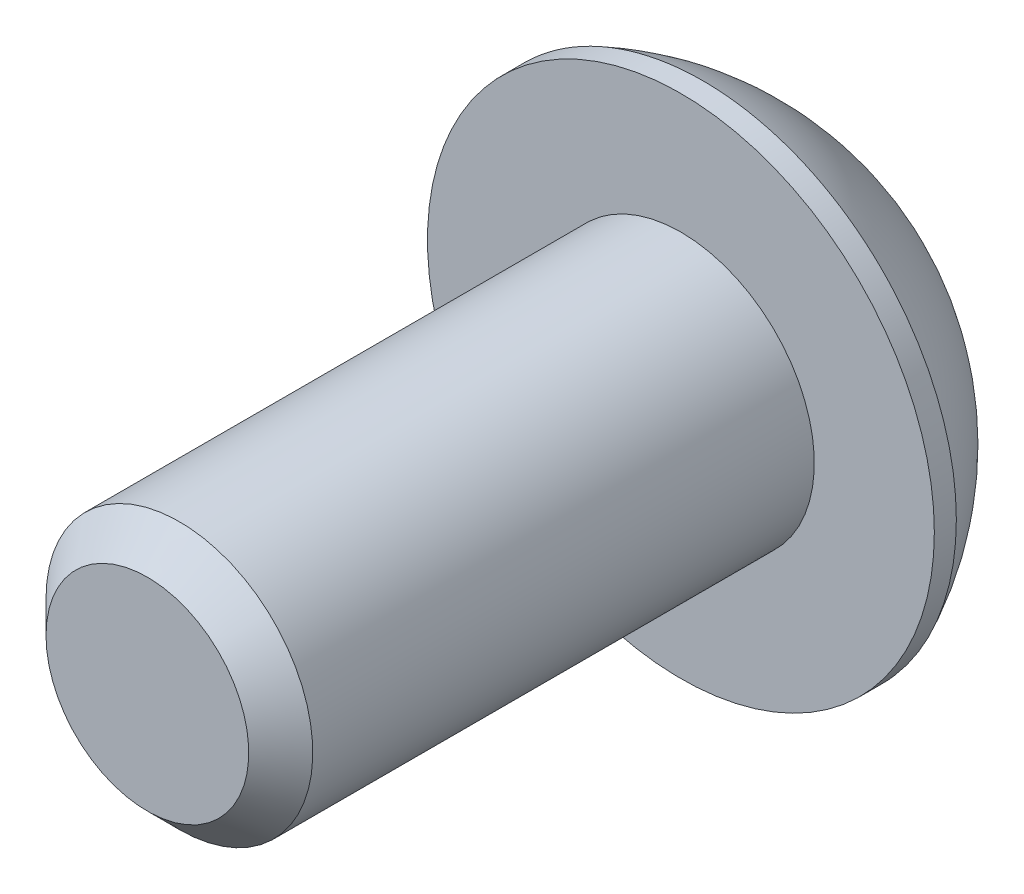
ISO-10303-21;
HEADER;
FILE_DESCRIPTION(('STEP AP214'),'2;1');
FILE_NAME('part.step','',(''),(''),'','','');
FILE_SCHEMA(('AUTOMOTIVE_DESIGN { 1 0 10303 214 1 1 1 1 }'));
ENDSEC;
DATA;
#1=APPLICATION_CONTEXT('core data for automotive mechanical design processes');
#2=APPLICATION_PROTOCOL_DEFINITION('international standard','automotive_design',2000,#1);
#3=PRODUCT_CONTEXT('',#1,'mechanical');
#4=PRODUCT('Part','Part','',(#3));
#5=PRODUCT_RELATED_PRODUCT_CATEGORY('part','',(#4));
#6=PRODUCT_DEFINITION_FORMATION('','',#4);
#7=PRODUCT_DEFINITION_CONTEXT('part definition',#1,'design');
#8=PRODUCT_DEFINITION('design','',#6,#7);
#9=PRODUCT_DEFINITION_SHAPE('','',#8);
#10=(LENGTH_UNIT() NAMED_UNIT(*) SI_UNIT(.MILLI.,.METRE.));
#11=(NAMED_UNIT(*) PLANE_ANGLE_UNIT() SI_UNIT($,.RADIAN.));
#12=(NAMED_UNIT(*) SI_UNIT($,.STERADIAN.) SOLID_ANGLE_UNIT());
#13=UNCERTAINTY_MEASURE_WITH_UNIT(LENGTH_MEASURE(1.E-05),#10,'distance_accuracy_value','');
#14=(GEOMETRIC_REPRESENTATION_CONTEXT(3) GLOBAL_UNCERTAINTY_ASSIGNED_CONTEXT((#13)) GLOBAL_UNIT_ASSIGNED_CONTEXT((#10,
#11,#12)) REPRESENTATION_CONTEXT('',''));
#15=CARTESIAN_POINT('',(0.,0.,0.));
#16=DIRECTION('',(0.,0.,1.));
#17=DIRECTION('',(1.,0.,0.));
#18=AXIS2_PLACEMENT_3D('',#15,#16,#17);
#19=CARTESIAN_POINT('',(1.5,-0.866025403784438,1.925));
#20=DIRECTION('',(0.,0.,1.));
#21=DIRECTION('',(1.,0.,0.));
#22=AXIS2_PLACEMENT_3D('',#19,#20,#21);
#23=PLANE('',#22);
#24=DIRECTION('',(-0.866025403784439,0.5,0.));
#25=VECTOR('',#24,1.);
#26=CARTESIAN_POINT('',(-1.5,-0.866025403784439,1.925));
#27=LINE('',#26,#25);
#28=CARTESIAN_POINT('',(-1.5,-0.866025403784439,1.925));
#29=VERTEX_POINT('',#28);
#30=CARTESIAN_POINT('',(0.,-1.73205080756888,1.925));
#31=VERTEX_POINT('',#30);
#32=EDGE_CURVE('E89',#29,#31,#27,.F.);
#33=ORIENTED_EDGE('',*,*,#32,.F.);
#34=DIRECTION('',(0.,1.,0.));
#35=VECTOR('',#34,1.);
#36=CARTESIAN_POINT('',(-1.5,0.866025403784438,1.925));
#37=LINE('',#36,#35);
#38=CARTESIAN_POINT('',(-1.5,0.86602540378444,1.925));
#39=VERTEX_POINT('',#38);
#40=EDGE_CURVE('E69',#39,#29,#37,.F.);
#41=ORIENTED_EDGE('',*,*,#40,.F.);
#42=DIRECTION('',(0.866025403784438,0.5,0.));
#43=VECTOR('',#42,1.);
#44=CARTESIAN_POINT('',(0.,1.73205080756888,1.925));
#45=LINE('',#44,#43);
#46=CARTESIAN_POINT('',(0.,1.73205080756888,1.925));
#47=VERTEX_POINT('',#46);
#48=EDGE_CURVE('E108',#47,#39,#45,.F.);
#49=ORIENTED_EDGE('',*,*,#48,.F.);
#50=DIRECTION('',(0.866025403784439,-0.5,0.));
#51=VECTOR('',#50,1.);
#52=CARTESIAN_POINT('',(1.5,0.866025403784439,1.925));
#53=LINE('',#52,#51);
#54=CARTESIAN_POINT('',(1.5,0.866025403784439,1.925));
#55=VERTEX_POINT('',#54);
#56=EDGE_CURVE('E74',#55,#47,#53,.F.);
#57=ORIENTED_EDGE('',*,*,#56,.F.);
#58=DIRECTION('',(0.,1.,0.));
#59=VECTOR('',#58,1.);
#60=CARTESIAN_POINT('',(1.5,-0.866025403784438,1.925));
#61=LINE('',#60,#59);
#62=CARTESIAN_POINT('',(1.5,-0.866025403784439,1.925));
#63=VERTEX_POINT('',#62);
#64=EDGE_CURVE('E116',#63,#55,#61,.T.);
#65=ORIENTED_EDGE('',*,*,#64,.F.);
#66=DIRECTION('',(-0.866025403784438,-0.5,0.));
#67=VECTOR('',#66,1.);
#68=CARTESIAN_POINT('',(0.,-1.73205080756888,1.925));
#69=LINE('',#68,#67);
#70=EDGE_CURVE('E91',#31,#63,#69,.F.);
#71=ORIENTED_EDGE('',*,*,#70,.F.);
#72=EDGE_LOOP('',(#33,#41,#49,#57,#65,#71));
#73=FACE_BOUND('',#72,.T.);
#74=ADVANCED_FACE('F17',(#73),#23,.F.);
#75=CARTESIAN_POINT('',(-1.5,0.866025403784438,1.925));
#76=DIRECTION('',(1.,0.,0.));
#77=DIRECTION('',(0.,1.,0.));
#78=AXIS2_PLACEMENT_3D('',#75,#76,#77);
#79=PLANE('',#78);
#80=DIRECTION('',(0.,0.,1.));
#81=VECTOR('',#80,1.);
#82=CARTESIAN_POINT('',(-1.5,-0.866025403784439,1.925));
#83=LINE('',#82,#81);
#84=CARTESIAN_POINT('',(-1.50000000002135,-0.866025403796766,2.46510916132268E-11));
#85=VERTEX_POINT('',#84);
#86=EDGE_CURVE('E59',#85,#29,#83,.T.);
#87=ORIENTED_EDGE('',*,*,#86,.F.);
#88=CARTESIAN_POINT('',(-1.4999999999998,-0.866025403812883,3.497257389451E-11));
#89=CARTESIAN_POINT('',(-1.49999999999993,-0.806493971458483,0.0297371504859719));
#90=CARTESIAN_POINT('',(-1.49999999999998,-0.745967172639482,0.0577274997356712));
#91=CARTESIAN_POINT('',(-1.50000000000002,-0.622546818448653,0.108976634302055));
#92=CARTESIAN_POINT('',(-1.50000000000001,-0.559641532208188,0.132206913934862));
#93=CARTESIAN_POINT('',(-1.5,-0.432796107455125,0.172000539080811));
#94=CARTESIAN_POINT('',(-1.5,-0.368888255245699,0.188663877377684));
#95=CARTESIAN_POINT('',(-1.5,-0.239666012718551,0.214336924424236));
#96=CARTESIAN_POINT('',(-1.5,-0.174355567110582,0.223365789946761));
#97=CARTESIAN_POINT('',(-1.5,-0.0617869553803678,0.231512589389946));
#98=CARTESIAN_POINT('',(-1.5,-0.0146740941290627,0.232718117598397));
#99=CARTESIAN_POINT('',(-1.5,0.0794684067864031,0.230683861885897));
#100=CARTESIAN_POINT('',(-1.5,0.126498025769629,0.227443096008092));
#101=CARTESIAN_POINT('',(-1.5,0.22010432228685,0.21670269479537));
#102=CARTESIAN_POINT('',(-1.5,0.266680537614034,0.209199099190673));
#103=CARTESIAN_POINT('',(-1.5,0.359051186180354,0.190340526502742));
#104=CARTESIAN_POINT('',(-1.5,0.404845275088566,0.178983896805698));
#105=CARTESIAN_POINT('',(-1.5,0.522097698449399,0.145281418704612));
#106=CARTESIAN_POINT('',(-1.5,0.592830045625335,0.120399016572433));
#107=CARTESIAN_POINT('',(-1.5,0.696834190269759,0.0783962698582894));
#108=CARTESIAN_POINT('',(-1.5,0.731106784740956,0.0636393457765503));
#109=CARTESIAN_POINT('',(-1.5,0.799022021654026,0.0327784721118597));
#110=CARTESIAN_POINT('',(-1.5,0.832664954619754,0.0166751634844623));
#111=CARTESIAN_POINT('',(-1.5,0.866025403812908,3.50675416900233E-11));
#112=B_SPLINE_CURVE_WITH_KNOTS('',3,(#88,#89,#90,#91,#92,#93,#94,#95,#96,#97,#98,#99,#100,#101,
#102,#103,#104,#105,#106,#107,#108,#109,#110,#111),.UNSPECIFIED.,.F.,.F.,(4,2,2,2,2,2,2,2,2,2,2,
4),(0.,0.199774419877747,0.400712312213008,0.598459990242252,0.795709985580835,
0.936894690699466,1.07811058125136,1.21945787975417,1.36086588065946,1.58533909974464,
1.69726364726936,1.80913521246463),.UNSPECIFIED.);
#113=CARTESIAN_POINT('',(-1.5000000000427,0.866025403774032,1.75297927214847E-11));
#114=VERTEX_POINT('',#113);
#115=EDGE_CURVE('E20',#85,#114,#112,.T.);
#116=ORIENTED_EDGE('',*,*,#115,.T.);
#117=DIRECTION('',(0.,0.,1.));
#118=VECTOR('',#117,1.);
#119=CARTESIAN_POINT('',(-1.5,0.86602540378444,1.925));
#120=LINE('',#119,#118);
#121=EDGE_CURVE('E85',#39,#114,#120,.F.);
#122=ORIENTED_EDGE('',*,*,#121,.F.);
#123=ORIENTED_EDGE('',*,*,#40,.T.);
#124=EDGE_LOOP('',(#87,#116,#122,#123));
#125=FACE_BOUND('',#124,.T.);
#126=ADVANCED_FACE('F84',(#125),#79,.T.);
#127=CARTESIAN_POINT('',(-1.5,-0.866025403784439,1.925));
#128=DIRECTION('',(0.5,0.866025403784439,0.));
#129=DIRECTION('',(-0.866025403784439,0.5,0.));
#130=AXIS2_PLACEMENT_3D('',#127,#128,#129);
#131=PLANE('',#130);
#132=DIRECTION('',(0.,0.,1.));
#133=VECTOR('',#132,1.);
#134=CARTESIAN_POINT('',(0.,-1.73205080756888,1.925));
#135=LINE('',#134,#133);
#136=CARTESIAN_POINT('',(0.,-1.73205080759353,2.46497940526791E-11));
#137=VERTEX_POINT('',#136);
#138=EDGE_CURVE('E94',#137,#31,#135,.T.);
#139=ORIENTED_EDGE('',*,*,#138,.F.);
#140=CARTESIAN_POINT('',(2.47314203792776E-11,-1.73205080758293,3.49731040819305E-11));
#141=CARTESIAN_POINT('',(-0.0515557327287603,-1.70228509139958,0.029737150484999));
#142=CARTESIAN_POINT('',(-0.103973478126701,-1.67202169198382,0.0577274997332092));
#143=CARTESIAN_POINT('',(-0.210858640221861,-1.61031151487585,0.108976634295228));
#144=CARTESIAN_POINT('',(-0.265336216149327,-1.57885887174931,0.132206913925155));
#145=CARTESIAN_POINT('',(-0.375187576360522,-1.51543615936052,0.172000539063643));
#146=CARTESIAN_POINT('',(-0.430533399885507,-1.48348223324985,0.188663877355986));
#147=CARTESIAN_POINT('',(-0.542443144668121,-1.41887111197467,0.214336924391903));
#148=CARTESIAN_POINT('',(-0.599003649706895,-1.38621588916503,0.223365789908325));
#149=CARTESIAN_POINT('',(-0.696490927156704,-1.32993158328682,0.231512589340654));
#150=CARTESIAN_POINT('',(-0.737291861858444,-1.30637515265358,0.232718117543908));
#151=CARTESIAN_POINT('',(-0.818821659252819,-1.25930390218097,0.230683861819339));
#152=CARTESIAN_POINT('',(-0.859550504035242,-1.23578909268205,0.22744309593466));
#153=CARTESIAN_POINT('',(-0.940615934798046,-1.18898594440917,0.216702694706976));
#154=CARTESIAN_POINT('',(-0.980952120495589,-1.16569783673861,0.20919909909419));
#155=CARTESIAN_POINT('',(-1.06094744874167,-1.11951251244183,0.19034052638936));
#156=CARTESIAN_POINT('',(-1.10060629309087,-1.09661546798107,0.178983896683506));
#157=CARTESIAN_POINT('',(-1.20214987033849,-1.03798925632268,0.145281418581615));
#158=CARTESIAN_POINT('',(-1.26340587981439,-1.00262308276228,0.120399016466317));
#159=CARTESIAN_POINT('',(-1.35347611110698,-0.950621010479538,0.0783962697862537));
#160=CARTESIAN_POINT('',(-1.38315704855032,-0.93348471325682,0.0636393457173699));
#161=CARTESIAN_POINT('',(-1.44197336897757,-0.899527094825408,0.0327784720806831));
#162=CARTESIAN_POINT('',(-1.4711090035625,-0.882705628354788,0.0166751634684291));
#163=CARTESIAN_POINT('',(-1.50000000002465,-0.866025403770205,3.50675335169267E-11));
#164=B_SPLINE_CURVE_WITH_KNOTS('',3,(#140,#141,#142,#143,#144,#145,#146,#147,#148,#149,#150,
#151,#152,#153,#154,#155,#156,#157,#158,#159,#160,#161,#162,#163),.UNSPECIFIED.,.F.,.F.,(4,2,2,
2,2,2,2,2,2,2,2,4),(0.,0.199774419910088,0.4007123122777,0.598459990337995,0.795709985707603,
0.936894690871224,1.07811058146816,1.21945788001607,1.36086588096647,1.58533909988034,
1.69726364731887,1.80913521242832),.UNSPECIFIED.);
#165=EDGE_CURVE('E98',#137,#85,#164,.T.);
#166=ORIENTED_EDGE('',*,*,#165,.T.);
#167=ORIENTED_EDGE('',*,*,#86,.T.);
#168=ORIENTED_EDGE('',*,*,#32,.T.);
#169=EDGE_LOOP('',(#139,#166,#167,#168));
#170=FACE_BOUND('',#169,.T.);
#171=ADVANCED_FACE('F96',(#170),#131,.T.);
#172=CARTESIAN_POINT('',(0.,-1.73205080756888,1.925));
#173=DIRECTION('',(-0.5,0.866025403784438,0.));
#174=DIRECTION('',(-0.866025403784438,-0.5,0.));
#175=AXIS2_PLACEMENT_3D('',#172,#173,#174);
#176=PLANE('',#175);
#177=DIRECTION('',(0.,0.,1.));
#178=VECTOR('',#177,1.);
#179=CARTESIAN_POINT('',(1.5,-0.866025403784439,1.925));
#180=LINE('',#179,#178);
#181=CARTESIAN_POINT('',(1.50000000002135,-0.866025403796764,2.46510166454315E-11));
#182=VERTEX_POINT('',#181);
#183=EDGE_CURVE('E118',#182,#63,#180,.T.);
#184=ORIENTED_EDGE('',*,*,#183,.F.);
#185=CARTESIAN_POINT('',(1.50000000002453,-0.86602540377005,3.49716705376729E-11));
#186=CARTESIAN_POINT('',(1.44844426727117,-0.895791119953619,0.0297371504849977));
#187=CARTESIAN_POINT('',(1.39602652187328,-0.926054519369463,0.0577274997332081));
#188=CARTESIAN_POINT('',(1.28914135977816,-0.987764696477502,0.108976634295226));
#189=CARTESIAN_POINT('',(1.23466378385068,-1.01921733960401,0.132206913925153));
#190=CARTESIAN_POINT('',(1.12481242363947,-1.08264005199279,0.172000539063641));
#191=CARTESIAN_POINT('',(1.06946660011449,-1.11459397810346,0.188663877355984));
#192=CARTESIAN_POINT('',(0.957556855331882,-1.17920509937865,0.214336924391901));
#193=CARTESIAN_POINT('',(0.900996350293107,-1.21186032218829,0.223365789908323));
#194=CARTESIAN_POINT('',(0.803509072843297,-1.2681446280665,0.231512589340651));
#195=CARTESIAN_POINT('',(0.762708138141558,-1.29170105869973,0.232718117543906));
#196=CARTESIAN_POINT('',(0.681178340747183,-1.33877230917235,0.230683861819337));
#197=CARTESIAN_POINT('',(0.64044949596476,-1.36228711867127,0.227443095934657));
#198=CARTESIAN_POINT('',(0.559384065201955,-1.40909026694414,0.216702694706973));
#199=CARTESIAN_POINT('',(0.519047879504413,-1.4323783746147,0.209199099094188));
#200=CARTESIAN_POINT('',(0.439052551258335,-1.47856369891149,0.190340526389358));
#201=CARTESIAN_POINT('',(0.399393706909129,-1.50146074337225,0.178983896683504));
#202=CARTESIAN_POINT('',(0.29785012966151,-1.56008695503064,0.145281418581613));
#203=CARTESIAN_POINT('',(0.236594120185611,-1.59545312859104,0.120399016466315));
#204=CARTESIAN_POINT('',(0.146523888893026,-1.64745520087378,0.0783962697862515));
#205=CARTESIAN_POINT('',(0.116842951449678,-1.6645914980965,0.0636393457173677));
#206=CARTESIAN_POINT('',(0.0580266310224356,-1.69854911652791,0.0327784720806809));
#207=CARTESIAN_POINT('',(0.0288909964375044,-1.71537058299853,0.0166751634684269));
#208=CARTESIAN_POINT('',(-2.46528885257916E-11,-1.73205080758311,3.50654309737692E-11));
#209=B_SPLINE_CURVE_WITH_KNOTS('',3,(#185,#186,#187,#188,#189,#190,#191,#192,#193,#194,#195,
#196,#197,#198,#199,#200,#201,#202,#203,#204,#205,#206,#207,#208),.UNSPECIFIED.,.F.,.F.,(4,2,2,
2,2,2,2,2,2,2,2,4),(0.,0.199774419910088,0.400712312277698,0.598459990337992,0.795709985707599,
0.93689469087122,1.07811058146816,1.21945788001607,1.36086588096647,1.58533909988034,
1.69726364731887,1.80913521242832),.UNSPECIFIED.);
#210=EDGE_CURVE('E176',#182,#137,#209,.T.);
#211=ORIENTED_EDGE('',*,*,#210,.T.);
#212=ORIENTED_EDGE('',*,*,#138,.T.);
#213=ORIENTED_EDGE('',*,*,#70,.T.);
#214=EDGE_LOOP('',(#184,#211,#212,#213));
#215=FACE_BOUND('',#214,.T.);
#216=ADVANCED_FACE('F174',(#215),#176,.T.);
#217=CARTESIAN_POINT('',(1.5,-0.866025403784438,1.925));
#218=DIRECTION('',(-1.,0.,0.));
#219=DIRECTION('',(0.,0.,1.));
#220=AXIS2_PLACEMENT_3D('',#217,#218,#219);
#221=PLANE('',#220);
#222=DIRECTION('',(0.,0.,1.));
#223=VECTOR('',#222,1.);
#224=CARTESIAN_POINT('',(1.5,0.866025403784439,1.925));
#225=LINE('',#224,#223);
#226=CARTESIAN_POINT('',(1.50000000002135,0.866025403796765,2.46510166454315E-11));
#227=VERTEX_POINT('',#226);
#228=EDGE_CURVE('E113',#227,#55,#225,.T.);
#229=ORIENTED_EDGE('',*,*,#228,.F.);
#230=CARTESIAN_POINT('',(1.4999999999998,0.866025403812882,3.49731264126921E-11));
#231=CARTESIAN_POINT('',(1.49999999999993,0.806493971458483,0.0297371504859723));
#232=CARTESIAN_POINT('',(1.49999999999998,0.745967172639481,0.0577274997356716));
#233=CARTESIAN_POINT('',(1.50000000000002,0.622546818448653,0.108976634302055));
#234=CARTESIAN_POINT('',(1.50000000000001,0.559641532208188,0.132206913934863));
#235=CARTESIAN_POINT('',(1.5,0.432796107455125,0.172000539080811));
#236=CARTESIAN_POINT('',(1.5,0.368888255245699,0.188663877377684));
#237=CARTESIAN_POINT('',(1.5,0.239666012718551,0.214336924424236));
#238=CARTESIAN_POINT('',(1.5,0.174355567110582,0.223365789946761));
#239=CARTESIAN_POINT('',(1.5,0.0617869553803679,0.231512589389946));
#240=CARTESIAN_POINT('',(1.5,0.0146740941290628,0.232718117598397));
#241=CARTESIAN_POINT('',(1.5,-0.0794684067864029,0.230683861885897));
#242=CARTESIAN_POINT('',(1.5,-0.126498025769629,0.227443096008093));
#243=CARTESIAN_POINT('',(1.5,-0.220104322286849,0.21670269479537));
#244=CARTESIAN_POINT('',(1.5,-0.266680537614034,0.209199099190673));
#245=CARTESIAN_POINT('',(1.5,-0.359051186180354,0.190340526502742));
#246=CARTESIAN_POINT('',(1.5,-0.404845275088565,0.178983896805698));
#247=CARTESIAN_POINT('',(1.5,-0.522097698449399,0.145281418704612));
#248=CARTESIAN_POINT('',(1.5,-0.592830045625335,0.120399016572433));
#249=CARTESIAN_POINT('',(1.5,-0.69683419026976,0.0783962698582893));
#250=CARTESIAN_POINT('',(1.5,-0.731106784740956,0.0636393457765502));
#251=CARTESIAN_POINT('',(1.5,-0.799022021654026,0.0327784721118594));
#252=CARTESIAN_POINT('',(1.5,-0.832664954619755,0.0166751634844619));
#253=CARTESIAN_POINT('',(1.5,-0.866025403812909,3.5067108651531E-11));
#254=B_SPLINE_CURVE_WITH_KNOTS('',3,(#230,#231,#232,#233,#234,#235,#236,#237,#238,#239,#240,
#241,#242,#243,#244,#245,#246,#247,#248,#249,#250,#251,#252,#253),.UNSPECIFIED.,.F.,.F.,(4,2,2,
2,2,2,2,2,2,2,2,4),(0.,0.199774419877746,0.400712312213007,0.598459990242251,0.795709985580833,
0.936894690699465,1.07811058125136,1.21945787975417,1.36086588065946,1.58533909974464,
1.69726364726936,1.80913521246463),.UNSPECIFIED.);
#255=EDGE_CURVE('E181',#227,#182,#254,.T.);
#256=ORIENTED_EDGE('',*,*,#255,.T.);
#257=ORIENTED_EDGE('',*,*,#183,.T.);
#258=ORIENTED_EDGE('',*,*,#64,.T.);
#259=EDGE_LOOP('',(#229,#256,#257,#258));
#260=FACE_BOUND('',#259,.T.);
#261=ADVANCED_FACE('F233',(#260),#221,.T.);
#262=CARTESIAN_POINT('',(1.5,0.866025403784439,1.925));
#263=DIRECTION('',(-0.5,-0.866025403784439,0.));
#264=DIRECTION('',(0.866025403784439,-0.5,0.));
#265=AXIS2_PLACEMENT_3D('',#262,#263,#264);
#266=PLANE('',#265);
#267=DIRECTION('',(0.,0.,1.));
#268=VECTOR('',#267,1.);
#269=CARTESIAN_POINT('',(0.,1.73205080756888,1.925));
#270=LINE('',#269,#268);
#271=CARTESIAN_POINT('',(0.,1.73205080759353,2.46496717940041E-11));
#272=VERTEX_POINT('',#271);
#273=EDGE_CURVE('E40',#272,#47,#270,.T.);
#274=ORIENTED_EDGE('',*,*,#273,.F.);
#275=CARTESIAN_POINT('',(-2.47305004476744E-11,1.73205080758293,3.49737059739202E-11));
#276=CARTESIAN_POINT('',(0.051555732728761,1.70228509139958,0.0297371504849995));
#277=CARTESIAN_POINT('',(0.103973478126702,1.67202169198382,0.0577274997332096));
#278=CARTESIAN_POINT('',(0.210858640221861,1.61031151487585,0.108976634295228));
#279=CARTESIAN_POINT('',(0.265336216149327,1.57885887174931,0.132206913925155));
#280=CARTESIAN_POINT('',(0.375187576360522,1.51543615936052,0.172000539063643));
#281=CARTESIAN_POINT('',(0.430533399885507,1.48348223324985,0.188663877355987));
#282=CARTESIAN_POINT('',(0.542443144668121,1.41887111197467,0.214336924391904));
#283=CARTESIAN_POINT('',(0.599003649706895,1.38621588916503,0.223365789908325));
#284=CARTESIAN_POINT('',(0.696490927156705,1.32993158328682,0.231512589340654));
#285=CARTESIAN_POINT('',(0.737291861858444,1.30637515265358,0.232718117543908));
#286=CARTESIAN_POINT('',(0.81882165925282,1.25930390218097,0.230683861819339));
#287=CARTESIAN_POINT('',(0.859550504035242,1.23578909268205,0.22744309593466));
#288=CARTESIAN_POINT('',(0.940615934798047,1.18898594440917,0.216702694706976));
#289=CARTESIAN_POINT('',(0.980952120495589,1.16569783673861,0.20919909909419));
#290=CARTESIAN_POINT('',(1.06094744874167,1.11951251244183,0.19034052638936));
#291=CARTESIAN_POINT('',(1.10060629309087,1.09661546798107,0.178983896683506));
#292=CARTESIAN_POINT('',(1.20214987033849,1.03798925632268,0.145281418581615));
#293=CARTESIAN_POINT('',(1.26340587981439,1.00262308276228,0.120399016466317));
#294=CARTESIAN_POINT('',(1.35347611110698,0.950621010479537,0.0783962697862536));
#295=CARTESIAN_POINT('',(1.38315704855032,0.93348471325682,0.0636393457173698));
#296=CARTESIAN_POINT('',(1.44197336897757,0.899527094825408,0.0327784720806828));
#297=CARTESIAN_POINT('',(1.4711090035625,0.882705628354787,0.0166751634684288));
#298=CARTESIAN_POINT('',(1.50000000002466,0.866025403770204,3.50673327179663E-11));
#299=B_SPLINE_CURVE_WITH_KNOTS('',3,(#275,#276,#277,#278,#279,#280,#281,#282,#283,#284,#285,
#286,#287,#288,#289,#290,#291,#292,#293,#294,#295,#296,#297,#298),.UNSPECIFIED.,.F.,.F.,(4,2,2,
2,2,2,2,2,2,2,2,4),(0.,0.199774419910088,0.4007123122777,0.598459990337994,0.795709985707602,
0.936894690871223,1.07811058146816,1.21945788001607,1.36086588096647,1.58533909988034,
1.69726364731887,1.80913521242832),.UNSPECIFIED.);
#300=EDGE_CURVE('E212',#272,#227,#299,.T.);
#301=ORIENTED_EDGE('',*,*,#300,.T.);
#302=ORIENTED_EDGE('',*,*,#228,.T.);
#303=ORIENTED_EDGE('',*,*,#56,.T.);
#304=EDGE_LOOP('',(#274,#301,#302,#303));
#305=FACE_BOUND('',#304,.T.);
#306=ADVANCED_FACE('F226',(#305),#266,.T.);
#307=CARTESIAN_POINT('',(0.,1.73205080756888,1.925));
#308=DIRECTION('',(0.5,-0.866025403784438,0.));
#309=DIRECTION('',(0.866025403784438,0.5,0.));
#310=AXIS2_PLACEMENT_3D('',#307,#308,#309);
#311=PLANE('',#310);
#312=ORIENTED_EDGE('',*,*,#121,.T.);
#313=CARTESIAN_POINT('',(-1.50000000002453,0.866025403770049,3.49715716480713E-11));
#314=CARTESIAN_POINT('',(-1.44844426727117,0.895791119953618,0.0297371504849977));
#315=CARTESIAN_POINT('',(-1.39602652187328,0.926054519369463,0.0577274997332081));
#316=CARTESIAN_POINT('',(-1.28914135977816,0.987764696477502,0.108976634295226));
#317=CARTESIAN_POINT('',(-1.23466378385068,1.01921733960401,0.132206913925154));
#318=CARTESIAN_POINT('',(-1.12481242363947,1.08264005199279,0.172000539063642));
#319=CARTESIAN_POINT('',(-1.06946660011449,1.11459397810346,0.188663877355985));
#320=CARTESIAN_POINT('',(-0.957556855331882,1.17920509937865,0.214336924391901));
#321=CARTESIAN_POINT('',(-0.900996350293106,1.21186032218828,0.223365789908323));
#322=CARTESIAN_POINT('',(-0.803509072843297,1.2681446280665,0.231512589340651));
#323=CARTESIAN_POINT('',(-0.762708138141558,1.29170105869973,0.232718117543906));
#324=CARTESIAN_POINT('',(-0.681178340747182,1.33877230917235,0.230683861819337));
#325=CARTESIAN_POINT('',(-0.64044949596476,1.36228711867127,0.227443095934658));
#326=CARTESIAN_POINT('',(-0.559384065201955,1.40909026694414,0.216702694706974));
#327=CARTESIAN_POINT('',(-0.519047879504412,1.4323783746147,0.209199099094188));
#328=CARTESIAN_POINT('',(-0.439052551258335,1.47856369891149,0.190340526389358));
#329=CARTESIAN_POINT('',(-0.399393706909128,1.50146074337225,0.178983896683504));
#330=CARTESIAN_POINT('',(-0.297850129661509,1.56008695503064,0.145281418581613));
#331=CARTESIAN_POINT('',(-0.23659412018561,1.59545312859104,0.120399016466315));
#332=CARTESIAN_POINT('',(-0.146523888893025,1.64745520087378,0.0783962697862515));
#333=CARTESIAN_POINT('',(-0.116842951449677,1.6645914980965,0.0636393457173676));
#334=CARTESIAN_POINT('',(-0.0580266310224344,1.69854911652791,0.0327784720806807));
#335=CARTESIAN_POINT('',(-0.0288909964375033,1.71537058299853,0.0166751634684267));
#336=CARTESIAN_POINT('',(2.46540148375053E-11,1.73205080758311,3.50653193413085E-11));
#337=B_SPLINE_CURVE_WITH_KNOTS('',3,(#313,#314,#315,#316,#317,#318,#319,#320,#321,#322,#323,
#324,#325,#326,#327,#328,#329,#330,#331,#332,#333,#334,#335,#336),.UNSPECIFIED.,.F.,.F.,(4,2,2,
2,2,2,2,2,2,2,2,4),(0.,0.199774419910088,0.400712312277699,0.598459990337993,0.795709985707601,
0.936894690871222,1.07811058146816,1.21945788001607,1.36086588096647,1.58533909988034,
1.69726364731887,1.80913521242832),.UNSPECIFIED.);
#338=EDGE_CURVE('E202',#114,#272,#337,.T.);
#339=ORIENTED_EDGE('',*,*,#338,.T.);
#340=ORIENTED_EDGE('',*,*,#273,.T.);
#341=ORIENTED_EDGE('',*,*,#48,.T.);
#342=EDGE_LOOP('',(#312,#339,#340,#341));
#343=FACE_BOUND('',#342,.T.);
#344=ADVANCED_FACE('F222',(#343),#311,.T.);
#345=CARTESIAN_POINT('',(0.,0.,0.));
#346=DIRECTION('',(0.,0.,-1.));
#347=DIRECTION('',(-1.,0.,0.));
#348=AXIS2_PLACEMENT_3D('',#345,#346,#347);
#349=CONICAL_SURFACE('',#348,1.73205080761818,0.785398163397448);
#350=ORIENTED_EDGE('',*,*,#115,.F.);
#351=CARTESIAN_POINT('',(0.,0.,0.));
#352=DIRECTION('',(0.,0.,-1.));
#353=DIRECTION('',(-1.,0.,0.));
#354=AXIS2_PLACEMENT_3D('',#351,#352,#353);
#355=CIRCLE('',#354,1.73205080761818);
#356=EDGE_CURVE('E200',#114,#85,#355,.F.);
#357=ORIENTED_EDGE('',*,*,#356,.F.);
#358=EDGE_LOOP('',(#350,#357));
#359=FACE_BOUND('',#358,.T.);
#360=ADVANCED_FACE('F225',(#359),#349,.F.);
#361=CARTESIAN_POINT('',(0.,0.,0.));
#362=DIRECTION('',(0.,0.,-1.));
#363=DIRECTION('',(-1.,0.,0.));
#364=AXIS2_PLACEMENT_3D('',#361,#362,#363);
#365=CONICAL_SURFACE('',#364,1.73205080761818,0.785398163519197);
#366=ORIENTED_EDGE('',*,*,#165,.F.);
#367=CARTESIAN_POINT('',(0.,0.,0.));
#368=DIRECTION('',(0.,0.,-1.));
#369=DIRECTION('',(-1.,0.,0.));
#370=AXIS2_PLACEMENT_3D('',#367,#368,#369);
#371=CIRCLE('',#370,1.73205080761818);
#372=EDGE_CURVE('E187',#85,#137,#371,.F.);
#373=ORIENTED_EDGE('',*,*,#372,.F.);
#374=EDGE_LOOP('',(#366,#373));
#375=FACE_BOUND('',#374,.T.);
#376=ADVANCED_FACE('F185',(#375),#365,.F.);
#377=CARTESIAN_POINT('',(0.,0.,0.));
#378=DIRECTION('',(0.,0.,-1.));
#379=DIRECTION('',(-1.,0.,0.));
#380=AXIS2_PLACEMENT_3D('',#377,#378,#379);
#381=CONICAL_SURFACE('',#380,1.73205080761818,0.785398163519197);
#382=ORIENTED_EDGE('',*,*,#210,.F.);
#383=CARTESIAN_POINT('',(0.,0.,0.));
#384=DIRECTION('',(0.,0.,-1.));
#385=DIRECTION('',(-1.,0.,0.));
#386=AXIS2_PLACEMENT_3D('',#383,#384,#385);
#387=CIRCLE('',#386,1.73205080761818);
#388=EDGE_CURVE('E190',#137,#182,#387,.F.);
#389=ORIENTED_EDGE('',*,*,#388,.F.);
#390=EDGE_LOOP('',(#382,#389));
#391=FACE_BOUND('',#390,.T.);
#392=ADVANCED_FACE('F191',(#391),#381,.F.);
#393=CARTESIAN_POINT('',(0.,0.,0.));
#394=DIRECTION('',(0.,0.,-1.));
#395=DIRECTION('',(-1.,0.,0.));
#396=AXIS2_PLACEMENT_3D('',#393,#394,#395);
#397=CONICAL_SURFACE('',#396,1.73205080761818,0.785398163397448);
#398=CARTESIAN_POINT('',(0.,0.,0.));
#399=DIRECTION('',(0.,0.,-1.));
#400=DIRECTION('',(-1.,0.,0.));
#401=AXIS2_PLACEMENT_3D('',#398,#399,#400);
#402=CIRCLE('',#401,1.73205080761818);
#403=EDGE_CURVE('E194',#182,#227,#402,.F.);
#404=ORIENTED_EDGE('',*,*,#403,.F.);
#405=ORIENTED_EDGE('',*,*,#255,.F.);
#406=EDGE_LOOP('',(#404,#405));
#407=FACE_BOUND('',#406,.T.);
#408=ADVANCED_FACE('F250',(#407),#397,.F.);
#409=CARTESIAN_POINT('',(0.,0.,0.));
#410=DIRECTION('',(0.,0.,-1.));
#411=DIRECTION('',(-1.,0.,0.));
#412=AXIS2_PLACEMENT_3D('',#409,#410,#411);
#413=CONICAL_SURFACE('',#412,1.73205080761818,0.785398163519197);
#414=ORIENTED_EDGE('',*,*,#300,.F.);
#415=CARTESIAN_POINT('',(0.,0.,0.));
#416=DIRECTION('',(0.,0.,-1.));
#417=DIRECTION('',(-1.,0.,0.));
#418=AXIS2_PLACEMENT_3D('',#415,#416,#417);
#419=CIRCLE('',#418,1.73205080761818);
#420=EDGE_CURVE('E435',#227,#272,#419,.F.);
#421=ORIENTED_EDGE('',*,*,#420,.F.);
#422=EDGE_LOOP('',(#414,#421));
#423=FACE_BOUND('',#422,.T.);
#424=ADVANCED_FACE('F253',(#423),#413,.F.);
#425=CARTESIAN_POINT('',(0.,0.,0.));
#426=DIRECTION('',(0.,0.,-1.));
#427=DIRECTION('',(-1.,0.,0.));
#428=AXIS2_PLACEMENT_3D('',#425,#426,#427);
#429=CONICAL_SURFACE('',#428,1.73205080761818,0.785398163519197);
#430=ORIENTED_EDGE('',*,*,#338,.F.);
#431=CARTESIAN_POINT('',(0.,0.,0.));
#432=DIRECTION('',(0.,0.,-1.));
#433=DIRECTION('',(-1.,0.,0.));
#434=AXIS2_PLACEMENT_3D('',#431,#432,#433);
#435=CIRCLE('',#434,1.73205080761818);
#436=EDGE_CURVE('E145',#272,#114,#435,.F.);
#437=ORIENTED_EDGE('',*,*,#436,.F.);
#438=EDGE_LOOP('',(#430,#437));
#439=FACE_BOUND('',#438,.T.);
#440=ADVANCED_FACE('F220',(#439),#429,.F.);
#441=CARTESIAN_POINT('',(0.,-2.5,0.));
#442=DIRECTION('',(0.,0.,-1.));
#443=DIRECTION('',(-1.,0.,0.));
#444=AXIS2_PLACEMENT_3D('',#441,#442,#443);
#445=PLANE('',#444);
#446=ORIENTED_EDGE('',*,*,#420,.T.);
#447=ORIENTED_EDGE('',*,*,#436,.T.);
#448=ORIENTED_EDGE('',*,*,#356,.T.);
#449=ORIENTED_EDGE('',*,*,#372,.T.);
#450=ORIENTED_EDGE('',*,*,#388,.T.);
#451=ORIENTED_EDGE('',*,*,#403,.T.);
#452=EDGE_LOOP('',(#446,#447,#448,#449,#450,#451));
#453=FACE_BOUND('',#452,.T.);
#454=CARTESIAN_POINT('',(0.,2.50000000000001,0.));
#455=CARTESIAN_POINT('',(0.14042610491613,2.49999377288615,-1.32593105193051E-13));
#456=CARTESIAN_POINT('',(0.280954031991922,2.48812860484107,-6.31471711953224E-13));
#457=CARTESIAN_POINT('',(0.558139658492342,2.4409607490297,6.32232181879444E-13));
#458=CARTESIAN_POINT('',(0.694792493265104,2.40562985309162,2.39753884257632E-12));
#459=CARTESIAN_POINT('',(0.960172122561409,2.31253633023375,2.40243984571378E-12));
#460=CARTESIAN_POINT('',(1.08890266852492,2.25478441650811,6.4371637005254E-13));
#461=CARTESIAN_POINT('',(1.33480476215491,2.11850293856877,-6.43556416365108E-13));
#462=CARTESIAN_POINT('',(1.4519791741075,2.03997854084978,-1.72659782751567E-13));
#463=CARTESIAN_POINT('',(1.67149637287933,1.86436525899235,1.7224414644879E-13));
#464=CARTESIAN_POINT('',(1.77383760642253,1.76727443311116,0.));
#465=CARTESIAN_POINT('',(1.9607710897206,1.55728537034384,0.));
#466=CARTESIAN_POINT('',(2.04536264247662,1.44438651299416,0.));
#467=CARTESIAN_POINT('',(2.19438926048051,1.20599153577208,0.));
#468=CARTESIAN_POINT('',(2.25882470109938,1.08049565055396,0.));
#469=CARTESIAN_POINT('',(2.36571190425966,0.82046757520668,0.));
#470=CARTESIAN_POINT('',(2.40816371100575,0.685935403248304,0.));
#471=CARTESIAN_POINT('',(2.46987884513361,0.411653235766121,0.));
#472=CARTESIAN_POINT('',(2.48914212830969,0.271903230295767,0.));
#473=CARTESIAN_POINT('',(2.50393321907299,-0.00884700938581499,0.));
#474=CARTESIAN_POINT('',(2.49946106942909,-0.149847241343802,0.));
#475=CARTESIAN_POINT('',(2.46690834048229,-0.42909566110566,0.));
#476=CARTESIAN_POINT('',(2.43882775236998,-0.567343847882595,0.));
#477=CARTESIAN_POINT('',(2.35985521676829,-0.83716381023195,0.));
#478=CARTESIAN_POINT('',(2.30896324519904,-0.968735578756534,0.));
#479=CARTESIAN_POINT('',(2.18581263152622,-1.22146756661806,0.));
#480=CARTESIAN_POINT('',(2.11355399637581,-1.34262778934312,0.));
#481=CARTESIAN_POINT('',(1.9497212937071,-1.571097303558,0.));
#482=CARTESIAN_POINT('',(1.85814723400703,-1.67840660065418,0.));
#483=CARTESIAN_POINT('',(1.65828316813499,-1.87612814061525,0.));
#484=CARTESIAN_POINT('',(1.54999315967222,-1.96654038116453,0.));
#485=CARTESIAN_POINT('',(1.31977122488191,-2.12790126296043,0.));
#486=CARTESIAN_POINT('',(1.1978392967716,-2.19884990166348,0.));
#487=CARTESIAN_POINT('',(0.943794829063103,-2.31926953799947,0.));
#488=CARTESIAN_POINT('',(0.811682289900807,-2.368740536552,0.));
#489=CARTESIAN_POINT('',(0.54102688833757,-2.44480055905627,0.));
#490=CARTESIAN_POINT('',(0.40248402622632,-2.47138958403887,1.86091487096489E-13));
#491=CARTESIAN_POINT('',(0.122900797575768,-2.50093087897621,-1.8559004359156E-13));
#492=CARTESIAN_POINT('',(-0.0181395689635298,-2.50388314893098,-6.93687455967223E-13));
#493=CARTESIAN_POINT('',(-0.298714091660284,-2.48606712714886,6.93687487218265E-13));
#494=CARTESIAN_POINT('',(-0.438248247749883,-2.46529883434335,2.5891599510617E-12));
#495=CARTESIAN_POINT('',(-0.711849384339752,-2.40063123468838,2.27462519808315E-12));
#496=CARTESIAN_POINT('',(-0.845916364605931,-2.35673192684851,0.));
#497=CARTESIAN_POINT('',(-1.10477735834652,-2.24704847617181,0.));
#498=CARTESIAN_POINT('',(-1.22957137303274,-2.18126433619496,2.01615343233563E-12));
#499=CARTESIAN_POINT('',(-1.46634390401783,-2.02967864834025,2.36532436318756E-12));
#500=CARTESIAN_POINT('',(-1.57832242207293,-1.94387710320558,6.33724587120533E-13));
#501=CARTESIAN_POINT('',(-1.78628528220637,-1.75469221428793,-6.33724843631077E-13));
#502=CARTESIAN_POINT('',(-1.88226961781078,-1.65130886338843,-1.69573609549075E-13));
#503=CARTESIAN_POINT('',(-2.05551937194207,-1.42989510132752,1.69790505201427E-13));
#504=CARTESIAN_POINT('',(-2.13278478437745,-1.31186468539968,0.));
#505=CARTESIAN_POINT('',(-2.26640324060879,-1.06450749101078,0.));
#506=CARTESIAN_POINT('',(-2.32275630647993,-0.935180724474396,0.));
#507=CARTESIAN_POINT('',(-2.41295047224871,-0.668901974735267,0.));
#508=CARTESIAN_POINT('',(-2.4467915805466,-0.531949994377864,0.));
#509=CARTESIAN_POINT('',(-2.49100125494042,-0.254308178115924,0.));
#510=CARTESIAN_POINT('',(-2.501369778741,-0.11361833547658,0.));
#511=CARTESIAN_POINT('',(-2.49833983643023,0.167504919749186,0.));
#512=CARTESIAN_POINT('',(-2.48494141562714,0.307938332823943,0.));
#513=CARTESIAN_POINT('',(-2.43475793877015,0.584562794538336,0.));
#514=CARTESIAN_POINT('',(-2.39797283569017,0.720753834646809,0.));
#515=CARTESIAN_POINT('',(-2.30205936796065,0.985029646530014,0.));
#516=CARTESIAN_POINT('',(-2.24293058718864,1.11311426728117,0.));
#517=CARTESIAN_POINT('',(-2.10401075902969,1.35753360981387,0.));
#518=CARTESIAN_POINT('',(-2.02422052292128,1.47386879269151,0.));
#519=CARTESIAN_POINT('',(-1.84625229096998,1.69148114008355,0.));
#520=CARTESIAN_POINT('',(-1.74807621990904,1.7927598788425,0.));
#521=CARTESIAN_POINT('',(-1.53608575842467,1.9774231538066,0.));
#522=CARTESIAN_POINT('',(-1.42226748721672,2.06080323621401,0.));
#523=CARTESIAN_POINT('',(-1.18220372565674,2.2073028677133,0.));
#524=CARTESIAN_POINT('',(-1.05595232774909,2.27041272419883,0.));
#525=CARTESIAN_POINT('',(-0.794745243184798,2.37446817640475,0.));
#526=CARTESIAN_POINT('',(-0.659800208998127,2.4154403407284,0.));
#527=CARTESIAN_POINT('',(-0.436662637239037,2.46313736176947,0.));
#528=CARTESIAN_POINT('',(-0.34991999775826,2.47694359911887,0.));
#529=CARTESIAN_POINT('',(-0.175464826042746,2.49537686389633,0.));
#530=CARTESIAN_POINT('',(-0.0877522938080067,2.50000389132438,0.));
#531=CARTESIAN_POINT('',(0.,2.50000000000001,0.));
#532=B_SPLINE_CURVE_WITH_KNOTS('',3,(#454,#455,#456,#457,#458,#459,#460,#461,#462,#463,#464,
#465,#466,#467,#468,#469,#470,#471,#472,#473,#474,#475,#476,#477,#478,#479,#480,#481,#482,#483,
#484,#485,#486,#487,#488,#489,#490,#491,#492,#493,#494,#495,#496,#497,#498,#499,#500,#501,#502,
#503,#504,#505,#506,#507,#508,#509,#510,#511,#512,#513,#514,#515,#516,#517,#518,#519,#520,#521,
#522,#523,#524,#525,#526,#527,#528,#529,#530,#531),.UNSPECIFIED.,.T.,.F.,(4,2,2,2,2,2,2,2,2,2,2,
2,2,2,2,2,2,2,2,2,2,2,2,2,2,2,2,2,2,2,2,2,2,2,2,2,2,2,4),(0.,0.420958019059747,
0.842422990224611,1.26368682467408,1.68484598149402,2.10604920874208,2.52726897280856,
2.94848089195443,3.36969196412426,3.7909038392729,4.21211495543996,4.63332622878055,
5.05453794675567,5.47574952765962,5.89696093807137,6.31817240620663,6.73938392938708,
7.16059543453285,7.58180692070278,8.00301840687236,8.42422991201778,8.84544143519829,
9.26665290333357,9.68786431374594,10.1090758946506,10.5302876126258,10.9514988859663,
11.3727100021334,11.793921877282,12.2151329494518,12.6363448685977,13.0575646326643,
13.4787678599123,13.8999270167319,14.3211908511815,14.742655822347,15.1636138414069,
15.4266705700074,15.689727298608),.UNSPECIFIED.);
#533=CARTESIAN_POINT('',(0.,2.50000000000001,0.));
#534=VERTEX_POINT('',#533);
#535=EDGE_CURVE('E137',#534,#534,#532,.F.);
#536=ORIENTED_EDGE('',*,*,#535,.F.);
#537=EDGE_LOOP('',(#536));
#538=FACE_BOUND('',#537,.T.);
#539=ADVANCED_FACE('F147',(#453,#538),#445,.T.);
#540=CARTESIAN_POINT('',(0.,0.,4.65805481283422));
#541=DIRECTION('',(0.,-1.,0.));
#542=DIRECTION('',(0.,0.,-1.));
#543=AXIS2_PLACEMENT_3D('',#540,#541,#542);
#544=SPHERICAL_SURFACE('',#543,5.28653711226622);
#545=ORIENTED_EDGE('',*,*,#535,.T.);
#546=EDGE_LOOP('',(#545));
#547=FACE_BOUND('',#546,.T.);
#548=CARTESIAN_POINT('',(0.,0.,2.3375));
#549=DIRECTION('',(0.,0.,1.));
#550=DIRECTION('',(1.,0.,0.));
#551=AXIS2_PLACEMENT_3D('',#548,#549,#550);
#552=CIRCLE('',#551,4.75);
#553=CARTESIAN_POINT('',(4.75,0.,2.3375));
#554=VERTEX_POINT('',#553);
#555=EDGE_CURVE('E134',#554,#554,#552,.T.);
#556=ORIENTED_EDGE('',*,*,#555,.F.);
#557=EDGE_LOOP('',(#556));
#558=FACE_BOUND('',#557,.T.);
#559=ADVANCED_FACE('F150',(#547,#558),#544,.T.);
#560=CARTESIAN_POINT('',(0.,0.,0.));
#561=DIRECTION('',(0.,0.,1.));
#562=DIRECTION('',(1.,0.,0.));
#563=AXIS2_PLACEMENT_3D('',#560,#561,#562);
#564=CYLINDRICAL_SURFACE('',#563,4.75);
#565=CARTESIAN_POINT('',(0.,0.,2.75));
#566=DIRECTION('',(0.,0.,1.));
#567=DIRECTION('',(1.,0.,0.));
#568=AXIS2_PLACEMENT_3D('',#565,#566,#567);
#569=CIRCLE('',#568,4.75);
#570=CARTESIAN_POINT('',(4.75,0.,2.75));
#571=VERTEX_POINT('',#570);
#572=EDGE_CURVE('E131',#571,#571,#569,.T.);
#573=ORIENTED_EDGE('',*,*,#572,.F.);
#574=EDGE_LOOP('',(#573));
#575=FACE_BOUND('',#574,.T.);
#576=ORIENTED_EDGE('',*,*,#555,.T.);
#577=EDGE_LOOP('',(#576));
#578=FACE_BOUND('',#577,.T.);
#579=ADVANCED_FACE('F155',(#575,#578),#564,.T.);
#580=CARTESIAN_POINT('',(0.,-2.50000000000007,12.7500000000001));
#581=DIRECTION('',(0.,0.,-1.));
#582=DIRECTION('',(0.,1.,0.));
#583=AXIS2_PLACEMENT_3D('',#580,#581,#582);
#584=PLANE('',#583);
#585=CARTESIAN_POINT('',(0.,0.,12.7499999999258));
#586=DIRECTION('',(0.,0.,-1.));
#587=DIRECTION('',(-1.,0.,0.));
#588=AXIS2_PLACEMENT_3D('',#585,#586,#587);
#589=CIRCLE('',#588,1.89999999992096);
#590=CARTESIAN_POINT('',(-1.89999999992096,0.,12.7499999999258));
#591=VERTEX_POINT('',#590);
#592=EDGE_CURVE('E128',#591,#591,#589,.T.);
#593=ORIENTED_EDGE('',*,*,#592,.F.);
#594=EDGE_LOOP('',(#593));
#595=FACE_BOUND('',#594,.T.);
#596=ADVANCED_FACE('F286',(#595),#584,.F.);
#597=CARTESIAN_POINT('',(0.,-4.75,2.75));
#598=DIRECTION('',(0.,0.,1.));
#599=DIRECTION('',(1.,0.,0.));
#600=AXIS2_PLACEMENT_3D('',#597,#598,#599);
#601=PLANE('',#600);
#602=CARTESIAN_POINT('',(0.,0.,2.75));
#603=DIRECTION('',(0.,0.,1.));
#604=DIRECTION('',(0.,-1.,0.));
#605=AXIS2_PLACEMENT_3D('',#602,#603,#604);
#606=CIRCLE('',#605,2.5);
#607=CARTESIAN_POINT('',(0.,-2.50000000000001,2.75));
#608=VERTEX_POINT('',#607);
#609=EDGE_CURVE('E31',#608,#608,#606,.T.);
#610=ORIENTED_EDGE('',*,*,#609,.F.);
#611=EDGE_LOOP('',(#610));
#612=FACE_BOUND('',#611,.T.);
#613=ORIENTED_EDGE('',*,*,#572,.T.);
#614=EDGE_LOOP('',(#613));
#615=FACE_BOUND('',#614,.T.);
#616=ADVANCED_FACE('F280',(#612,#615),#601,.T.);
#617=CARTESIAN_POINT('',(0.,0.,12.1500000000196));
#618=DIRECTION('',(0.,0.,-1.));
#619=DIRECTION('',(-1.,0.,0.));
#620=AXIS2_PLACEMENT_3D('',#617,#618,#619);
#621=CONICAL_SURFACE('',#620,2.49999999982713,0.785398163397448);
#622=ORIENTED_EDGE('',*,*,#592,.T.);
#623=EDGE_LOOP('',(#622));
#624=FACE_BOUND('',#623,.T.);
#625=CARTESIAN_POINT('',(0.,0.,12.1500000000001));
#626=DIRECTION('',(0.,0.,1.));
#627=DIRECTION('',(0.,-1.,0.));
#628=AXIS2_PLACEMENT_3D('',#625,#626,#627);
#629=CIRCLE('',#628,2.5);
#630=CARTESIAN_POINT('',(0.,-2.5,12.1500000000001));
#631=VERTEX_POINT('',#630);
#632=EDGE_CURVE('E11',#631,#631,#629,.F.);
#633=ORIENTED_EDGE('',*,*,#632,.F.);
#634=EDGE_LOOP('',(#633));
#635=FACE_BOUND('',#634,.T.);
#636=ADVANCED_FACE('F274',(#624,#635),#621,.T.);
#637=CARTESIAN_POINT('',(0.,0.,32.75));
#638=DIRECTION('',(0.,0.,1.));
#639=DIRECTION('',(0.,-1.,0.));
#640=AXIS2_PLACEMENT_3D('',#637,#638,#639);
#641=CYLINDRICAL_SURFACE('',#640,2.5);
#642=ORIENTED_EDGE('',*,*,#632,.T.);
#643=EDGE_LOOP('',(#642));
#644=FACE_BOUND('',#643,.T.);
#645=ORIENTED_EDGE('',*,*,#609,.T.);
#646=EDGE_LOOP('',(#645));
#647=FACE_BOUND('',#646,.T.);
#648=ADVANCED_FACE('F272',(#644,#647),#641,.T.);
#649=CLOSED_SHELL('',(#74,#126,#171,#216,#261,#306,#344,#360,#376,#392,#408,#424,#440,#539,#559,
#579,#596,#616,#636,#648));
#650=MANIFOLD_SOLID_BREP('B1',#649);
#651=ADVANCED_BREP_SHAPE_REPRESENTATION('',(#18,#650),#14);
#652=SHAPE_DEFINITION_REPRESENTATION(#9,#651);
ENDSEC;
END-ISO-10303-21;
